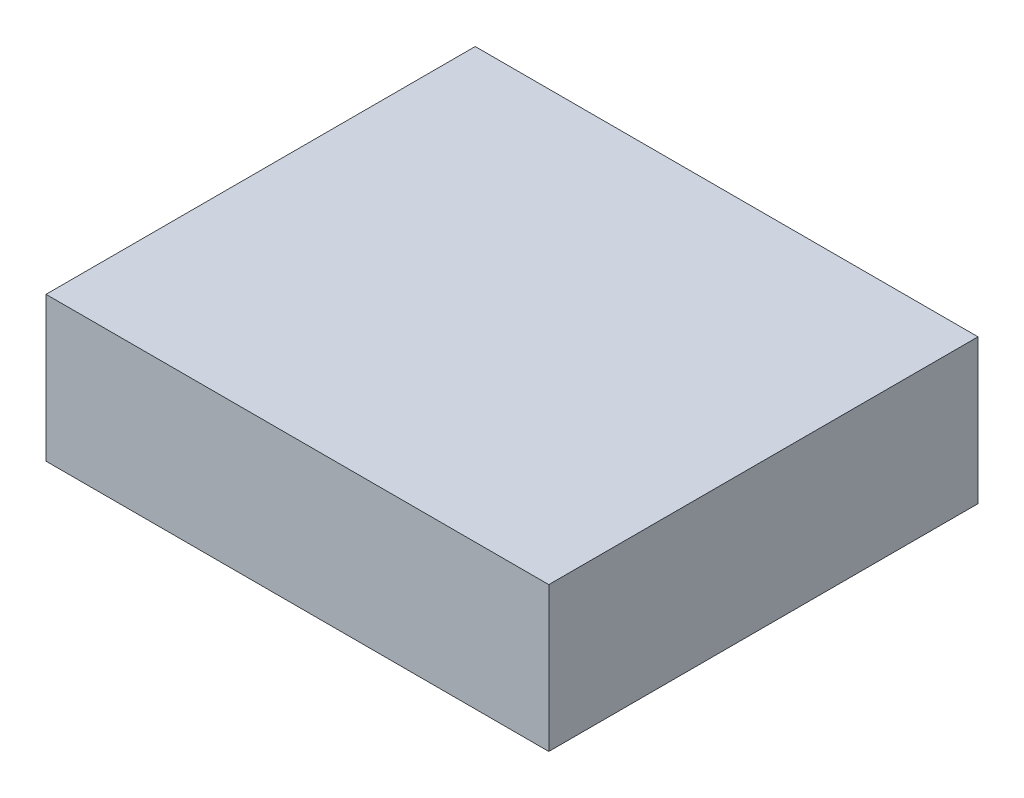
ISO-10303-21;
HEADER;
FILE_DESCRIPTION(('STEP AP214'),'2;1');
FILE_NAME('part.step','',(''),(''),'','','');
FILE_SCHEMA(('AUTOMOTIVE_DESIGN { 1 0 10303 214 1 1 1 1 }'));
ENDSEC;
DATA;
#1=APPLICATION_CONTEXT('core data for automotive mechanical design processes');
#2=APPLICATION_PROTOCOL_DEFINITION('international standard','automotive_design',2000,#1);
#3=PRODUCT_CONTEXT('',#1,'mechanical');
#4=PRODUCT('Part','Part','',(#3));
#5=PRODUCT_RELATED_PRODUCT_CATEGORY('part','',(#4));
#6=PRODUCT_DEFINITION_FORMATION('','',#4);
#7=PRODUCT_DEFINITION_CONTEXT('part definition',#1,'design');
#8=PRODUCT_DEFINITION('design','',#6,#7);
#9=PRODUCT_DEFINITION_SHAPE('','',#8);
#10=(LENGTH_UNIT() NAMED_UNIT(*) SI_UNIT(.MILLI.,.METRE.));
#11=(NAMED_UNIT(*) PLANE_ANGLE_UNIT() SI_UNIT($,.RADIAN.));
#12=(NAMED_UNIT(*) SI_UNIT($,.STERADIAN.) SOLID_ANGLE_UNIT());
#13=UNCERTAINTY_MEASURE_WITH_UNIT(LENGTH_MEASURE(1.E-05),#10,'distance_accuracy_value','');
#14=(GEOMETRIC_REPRESENTATION_CONTEXT(3) GLOBAL_UNCERTAINTY_ASSIGNED_CONTEXT((#13)) GLOBAL_UNIT_ASSIGNED_CONTEXT((#10,
#11,#12)) REPRESENTATION_CONTEXT('',''));
#15=CARTESIAN_POINT('',(0.,0.,0.));
#16=DIRECTION('',(0.,0.,1.));
#17=DIRECTION('',(1.,0.,0.));
#18=AXIS2_PLACEMENT_3D('',#15,#16,#17);
#19=CARTESIAN_POINT('',(-28.7,16.5,-24.5));
#20=DIRECTION('',(1.,0.,0.));
#21=DIRECTION('',(0.,0.,-1.));
#22=AXIS2_PLACEMENT_3D('',#19,#20,#21);
#23=PLANE('',#22);
#24=DIRECTION('',(0.,0.,1.));
#25=VECTOR('',#24,1.);
#26=CARTESIAN_POINT('',(-28.7,0.,-24.5));
#27=LINE('',#26,#25);
#28=CARTESIAN_POINT('',(-28.7,0.,-24.5));
#29=VERTEX_POINT('',#28);
#30=CARTESIAN_POINT('',(-28.7,0.,24.5));
#31=VERTEX_POINT('',#30);
#32=EDGE_CURVE('E96',#29,#31,#27,.T.);
#33=ORIENTED_EDGE('',*,*,#32,.T.);
#34=DIRECTION('',(0.,-1.,0.));
#35=VECTOR('',#34,1.);
#36=CARTESIAN_POINT('',(-28.7,16.5,24.5));
#37=LINE('',#36,#35);
#38=CARTESIAN_POINT('',(-28.7,16.5,24.5));
#39=VERTEX_POINT('',#38);
#40=EDGE_CURVE('E11',#39,#31,#37,.T.);
#41=ORIENTED_EDGE('',*,*,#40,.F.);
#42=DIRECTION('',(0.,0.,1.));
#43=VECTOR('',#42,1.);
#44=CARTESIAN_POINT('',(-28.7,16.5,-24.5));
#45=LINE('',#44,#43);
#46=CARTESIAN_POINT('',(-28.7,16.5,-24.5));
#47=VERTEX_POINT('',#46);
#48=EDGE_CURVE('E84',#47,#39,#45,.T.);
#49=ORIENTED_EDGE('',*,*,#48,.F.);
#50=DIRECTION('',(0.,-1.,0.));
#51=VECTOR('',#50,1.);
#52=CARTESIAN_POINT('',(-28.7,16.5,-24.5));
#53=LINE('',#52,#51);
#54=EDGE_CURVE('E92',#47,#29,#53,.T.);
#55=ORIENTED_EDGE('',*,*,#54,.T.);
#56=EDGE_LOOP('',(#33,#41,#49,#55));
#57=FACE_BOUND('',#56,.T.);
#58=ADVANCED_FACE('F33',(#57),#23,.F.);
#59=CARTESIAN_POINT('',(-28.7,16.5,24.5));
#60=DIRECTION('',(0.,0.,-1.));
#61=DIRECTION('',(-1.,0.,0.));
#62=AXIS2_PLACEMENT_3D('',#59,#60,#61);
#63=PLANE('',#62);
#64=DIRECTION('',(1.,0.,0.));
#65=VECTOR('',#64,1.);
#66=CARTESIAN_POINT('',(-28.7,0.,24.5));
#67=LINE('',#66,#65);
#68=CARTESIAN_POINT('',(28.7,0.,24.5));
#69=VERTEX_POINT('',#68);
#70=EDGE_CURVE('E88',#31,#69,#67,.T.);
#71=ORIENTED_EDGE('',*,*,#70,.T.);
#72=DIRECTION('',(0.,-1.,0.));
#73=VECTOR('',#72,1.);
#74=CARTESIAN_POINT('',(28.7,16.5,24.5));
#75=LINE('',#74,#73);
#76=CARTESIAN_POINT('',(28.7,16.5,24.5));
#77=VERTEX_POINT('',#76);
#78=EDGE_CURVE('E41',#77,#69,#75,.T.);
#79=ORIENTED_EDGE('',*,*,#78,.F.);
#80=DIRECTION('',(1.,0.,0.));
#81=VECTOR('',#80,1.);
#82=CARTESIAN_POINT('',(-28.7,16.5,24.5));
#83=LINE('',#82,#81);
#84=EDGE_CURVE('E79',#39,#77,#83,.T.);
#85=ORIENTED_EDGE('',*,*,#84,.F.);
#86=ORIENTED_EDGE('',*,*,#40,.T.);
#87=EDGE_LOOP('',(#71,#79,#85,#86));
#88=FACE_BOUND('',#87,.T.);
#89=ADVANCED_FACE('F87',(#88),#63,.F.);
#90=CARTESIAN_POINT('',(28.7,16.5,-24.5));
#91=DIRECTION('',(-1.,0.,0.));
#92=DIRECTION('',(0.,0.,1.));
#93=AXIS2_PLACEMENT_3D('',#90,#91,#92);
#94=PLANE('',#93);
#95=DIRECTION('',(0.,0.,-1.));
#96=VECTOR('',#95,1.);
#97=CARTESIAN_POINT('',(28.7,0.,-24.5));
#98=LINE('',#97,#96);
#99=CARTESIAN_POINT('',(28.7,0.,-24.5));
#100=VERTEX_POINT('',#99);
#101=EDGE_CURVE('E66',#69,#100,#98,.T.);
#102=ORIENTED_EDGE('',*,*,#101,.T.);
#103=DIRECTION('',(0.,-1.,0.));
#104=VECTOR('',#103,1.);
#105=CARTESIAN_POINT('',(28.7,16.5,-24.5));
#106=LINE('',#105,#104);
#107=CARTESIAN_POINT('',(28.7,16.5,-24.5));
#108=VERTEX_POINT('',#107);
#109=EDGE_CURVE('E89',#108,#100,#106,.T.);
#110=ORIENTED_EDGE('',*,*,#109,.F.);
#111=DIRECTION('',(0.,0.,-1.));
#112=VECTOR('',#111,1.);
#113=CARTESIAN_POINT('',(28.7,16.5,-24.5));
#114=LINE('',#113,#112);
#115=EDGE_CURVE('E82',#77,#108,#114,.T.);
#116=ORIENTED_EDGE('',*,*,#115,.F.);
#117=ORIENTED_EDGE('',*,*,#78,.T.);
#118=EDGE_LOOP('',(#102,#110,#116,#117));
#119=FACE_BOUND('',#118,.T.);
#120=ADVANCED_FACE('F90',(#119),#94,.F.);
#121=CARTESIAN_POINT('',(-28.7,16.5,-24.5));
#122=DIRECTION('',(0.,0.,1.));
#123=DIRECTION('',(1.,0.,0.));
#124=AXIS2_PLACEMENT_3D('',#121,#122,#123);
#125=PLANE('',#124);
#126=DIRECTION('',(-1.,0.,0.));
#127=VECTOR('',#126,1.);
#128=CARTESIAN_POINT('',(-28.7,0.,-24.5));
#129=LINE('',#128,#127);
#130=EDGE_CURVE('E72',#100,#29,#129,.T.);
#131=ORIENTED_EDGE('',*,*,#130,.T.);
#132=ORIENTED_EDGE('',*,*,#54,.F.);
#133=DIRECTION('',(-1.,0.,0.));
#134=VECTOR('',#133,1.);
#135=CARTESIAN_POINT('',(-28.7,16.5,-24.5));
#136=LINE('',#135,#134);
#137=EDGE_CURVE('E49',#108,#47,#136,.T.);
#138=ORIENTED_EDGE('',*,*,#137,.F.);
#139=ORIENTED_EDGE('',*,*,#109,.T.);
#140=EDGE_LOOP('',(#131,#132,#138,#139));
#141=FACE_BOUND('',#140,.T.);
#142=ADVANCED_FACE('F103',(#141),#125,.F.);
#143=CARTESIAN_POINT('',(0.,16.5,0.));
#144=DIRECTION('',(0.,1.,0.));
#145=DIRECTION('',(0.,0.,1.));
#146=AXIS2_PLACEMENT_3D('',#143,#144,#145);
#147=PLANE('',#146);
#148=ORIENTED_EDGE('',*,*,#48,.T.);
#149=ORIENTED_EDGE('',*,*,#84,.T.);
#150=ORIENTED_EDGE('',*,*,#115,.T.);
#151=ORIENTED_EDGE('',*,*,#137,.T.);
#152=EDGE_LOOP('',(#148,#149,#150,#151));
#153=FACE_BOUND('',#152,.T.);
#154=ADVANCED_FACE('F80',(#153),#147,.T.);
#155=CARTESIAN_POINT('',(0.,0.,0.));
#156=DIRECTION('',(0.,1.,0.));
#157=DIRECTION('',(0.,0.,1.));
#158=AXIS2_PLACEMENT_3D('',#155,#156,#157);
#159=PLANE('',#158);
#160=ORIENTED_EDGE('',*,*,#32,.F.);
#161=ORIENTED_EDGE('',*,*,#130,.F.);
#162=ORIENTED_EDGE('',*,*,#101,.F.);
#163=ORIENTED_EDGE('',*,*,#70,.F.);
#164=EDGE_LOOP('',(#160,#161,#162,#163));
#165=FACE_BOUND('',#164,.T.);
#166=ADVANCED_FACE('F106',(#165),#159,.F.);
#167=CLOSED_SHELL('',(#58,#89,#120,#142,#154,#166));
#168=MANIFOLD_SOLID_BREP('B2',#167);
#169=ADVANCED_BREP_SHAPE_REPRESENTATION('',(#18,#168),#14);
#170=SHAPE_DEFINITION_REPRESENTATION(#9,#169);
ENDSEC;
END-ISO-10303-21;
